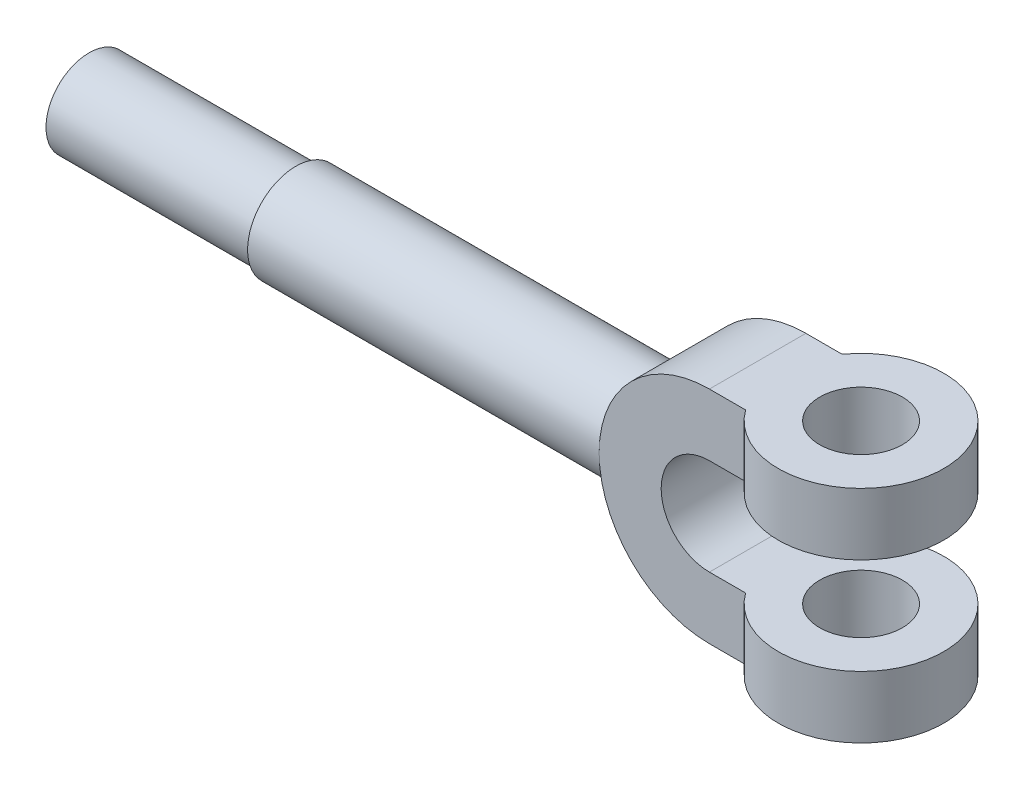
ISO-10303-21;
HEADER;
FILE_DESCRIPTION(('STEP AP214'),'2;1');
FILE_NAME('part.step','',(''),(''),'','','');
FILE_SCHEMA(('AUTOMOTIVE_DESIGN { 1 0 10303 214 1 1 1 1 }'));
ENDSEC;
DATA;
#1=APPLICATION_CONTEXT('core data for automotive mechanical design processes');
#2=APPLICATION_PROTOCOL_DEFINITION('international standard','automotive_design',2000,#1);
#3=PRODUCT_CONTEXT('',#1,'mechanical');
#4=PRODUCT('Part','Part','',(#3));
#5=PRODUCT_RELATED_PRODUCT_CATEGORY('part','',(#4));
#6=PRODUCT_DEFINITION_FORMATION('','',#4);
#7=PRODUCT_DEFINITION_CONTEXT('part definition',#1,'design');
#8=PRODUCT_DEFINITION('design','',#6,#7);
#9=PRODUCT_DEFINITION_SHAPE('','',#8);
#10=(LENGTH_UNIT() NAMED_UNIT(*) SI_UNIT(.MILLI.,.METRE.));
#11=(NAMED_UNIT(*) PLANE_ANGLE_UNIT() SI_UNIT($,.RADIAN.));
#12=(NAMED_UNIT(*) SI_UNIT($,.STERADIAN.) SOLID_ANGLE_UNIT());
#13=UNCERTAINTY_MEASURE_WITH_UNIT(LENGTH_MEASURE(1.E-05),#10,'distance_accuracy_value','');
#14=(GEOMETRIC_REPRESENTATION_CONTEXT(3) GLOBAL_UNCERTAINTY_ASSIGNED_CONTEXT((#13)) GLOBAL_UNIT_ASSIGNED_CONTEXT((#10,
#11,#12)) REPRESENTATION_CONTEXT('',''));
#15=CARTESIAN_POINT('',(0.,0.,0.));
#16=DIRECTION('',(0.,0.,1.));
#17=DIRECTION('',(1.,0.,0.));
#18=AXIS2_PLACEMENT_3D('',#15,#16,#17);
#19=CARTESIAN_POINT('',(-30.,0.,14.));
#20=DIRECTION('',(0.,0.,1.));
#21=DIRECTION('',(1.,0.,0.));
#22=AXIS2_PLACEMENT_3D('',#19,#20,#21);
#23=PLANE('',#22);
#24=DIRECTION('',(0.,-1.,0.));
#25=VECTOR('',#24,1.);
#26=CARTESIAN_POINT('',(-19.4935886896179,-14.,14.));
#27=LINE('',#26,#25);
#28=CARTESIAN_POINT('',(-19.4935886896179,-14.,14.));
#29=VERTEX_POINT('',#28);
#30=CARTESIAN_POINT('',(-19.4935886896179,-32.,14.));
#31=VERTEX_POINT('',#30);
#32=EDGE_CURVE('E117',#29,#31,#27,.T.);
#33=ORIENTED_EDGE('',*,*,#32,.F.);
#34=DIRECTION('',(-1.,0.,0.));
#35=VECTOR('',#34,1.);
#36=CARTESIAN_POINT('',(-30.,-14.,14.));
#37=LINE('',#36,#35);
#38=CARTESIAN_POINT('',(-30.,-14.,14.));
#39=VERTEX_POINT('',#38);
#40=EDGE_CURVE('E144',#29,#39,#37,.T.);
#41=ORIENTED_EDGE('',*,*,#40,.T.);
#42=CARTESIAN_POINT('',(-30.,0.,14.));
#43=DIRECTION('',(0.,0.,-1.));
#44=DIRECTION('',(1.,0.,0.));
#45=AXIS2_PLACEMENT_3D('',#42,#43,#44);
#46=CIRCLE('',#45,14.);
#47=CARTESIAN_POINT('',(-30.,14.,14.));
#48=VERTEX_POINT('',#47);
#49=EDGE_CURVE('E134',#39,#48,#46,.T.);
#50=ORIENTED_EDGE('',*,*,#49,.T.);
#51=DIRECTION('',(1.,0.,0.));
#52=VECTOR('',#51,1.);
#53=CARTESIAN_POINT('',(-30.,14.,14.));
#54=LINE('',#53,#52);
#55=CARTESIAN_POINT('',(-19.4935886896179,14.,14.));
#56=VERTEX_POINT('',#55);
#57=EDGE_CURVE('E183',#48,#56,#54,.T.);
#58=ORIENTED_EDGE('',*,*,#57,.T.);
#59=DIRECTION('',(0.,1.,0.));
#60=VECTOR('',#59,1.);
#61=CARTESIAN_POINT('',(-19.4935886896179,14.,14.));
#62=LINE('',#61,#60);
#63=CARTESIAN_POINT('',(-19.4935886896179,32.,14.));
#64=VERTEX_POINT('',#63);
#65=EDGE_CURVE('E246',#64,#56,#62,.F.);
#66=ORIENTED_EDGE('',*,*,#65,.F.);
#67=DIRECTION('',(-1.,0.,0.));
#68=VECTOR('',#67,1.);
#69=CARTESIAN_POINT('',(-30.,32.,14.));
#70=LINE('',#69,#68);
#71=CARTESIAN_POINT('',(-30.,32.,14.));
#72=VERTEX_POINT('',#71);
#73=EDGE_CURVE('E181',#64,#72,#70,.T.);
#74=ORIENTED_EDGE('',*,*,#73,.T.);
#75=CARTESIAN_POINT('',(-30.,0.,14.));
#76=DIRECTION('',(0.,0.,1.));
#77=DIRECTION('',(1.,0.,0.));
#78=AXIS2_PLACEMENT_3D('',#75,#76,#77);
#79=CIRCLE('',#78,32.);
#80=CARTESIAN_POINT('',(-62.,0.,14.));
#81=VERTEX_POINT('',#80);
#82=EDGE_CURVE('E177',#72,#81,#79,.T.);
#83=ORIENTED_EDGE('',*,*,#82,.T.);
#84=CARTESIAN_POINT('',(-30.,-32.,14.));
#85=VERTEX_POINT('',#84);
#86=EDGE_CURVE('E180',#81,#85,#79,.T.);
#87=ORIENTED_EDGE('',*,*,#86,.T.);
#88=DIRECTION('',(1.,0.,0.));
#89=VECTOR('',#88,1.);
#90=CARTESIAN_POINT('',(-30.,-32.,14.));
#91=LINE('',#90,#89);
#92=EDGE_CURVE('E175',#85,#31,#91,.T.);
#93=ORIENTED_EDGE('',*,*,#92,.T.);
#94=EDGE_LOOP('',(#33,#41,#50,#58,#66,#74,#83,#87,#93));
#95=FACE_BOUND('',#94,.T.);
#96=ADVANCED_FACE('F33',(#95),#23,.T.);
#97=CARTESIAN_POINT('',(-30.,0.,-14.));
#98=DIRECTION('',(0.,0.,1.));
#99=DIRECTION('',(1.,0.,0.));
#100=AXIS2_PLACEMENT_3D('',#97,#98,#99);
#101=PLANE('',#100);
#102=DIRECTION('',(-1.,0.,0.));
#103=VECTOR('',#102,1.);
#104=CARTESIAN_POINT('',(-30.,-14.,-14.));
#105=LINE('',#104,#103);
#106=CARTESIAN_POINT('',(-19.4935886896179,-14.,-14.));
#107=VERTEX_POINT('',#106);
#108=CARTESIAN_POINT('',(-30.,-14.,-14.));
#109=VERTEX_POINT('',#108);
#110=EDGE_CURVE('E127',#107,#109,#105,.T.);
#111=ORIENTED_EDGE('',*,*,#110,.F.);
#112=DIRECTION('',(0.,-1.,0.));
#113=VECTOR('',#112,1.);
#114=CARTESIAN_POINT('',(-19.4935886896179,-14.,-14.));
#115=LINE('',#114,#113);
#116=CARTESIAN_POINT('',(-19.4935886896179,-32.,-14.));
#117=VERTEX_POINT('',#116);
#118=EDGE_CURVE('E11',#107,#117,#115,.T.);
#119=ORIENTED_EDGE('',*,*,#118,.T.);
#120=DIRECTION('',(1.,0.,0.));
#121=VECTOR('',#120,1.);
#122=CARTESIAN_POINT('',(-30.,-32.,-14.));
#123=LINE('',#122,#121);
#124=CARTESIAN_POINT('',(-30.,-32.,-14.));
#125=VERTEX_POINT('',#124);
#126=EDGE_CURVE('E125',#125,#117,#123,.T.);
#127=ORIENTED_EDGE('',*,*,#126,.F.);
#128=CARTESIAN_POINT('',(-30.,0.,-14.));
#129=DIRECTION('',(0.,0.,1.));
#130=DIRECTION('',(1.,0.,0.));
#131=AXIS2_PLACEMENT_3D('',#128,#129,#130);
#132=CIRCLE('',#131,32.);
#133=CARTESIAN_POINT('',(-62.,0.,-14.));
#134=VERTEX_POINT('',#133);
#135=EDGE_CURVE('E137',#134,#125,#132,.T.);
#136=ORIENTED_EDGE('',*,*,#135,.F.);
#137=CARTESIAN_POINT('',(-30.,32.,-14.));
#138=VERTEX_POINT('',#137);
#139=EDGE_CURVE('E132',#138,#134,#132,.T.);
#140=ORIENTED_EDGE('',*,*,#139,.F.);
#141=DIRECTION('',(-1.,0.,0.));
#142=VECTOR('',#141,1.);
#143=CARTESIAN_POINT('',(-30.,32.,-14.));
#144=LINE('',#143,#142);
#145=CARTESIAN_POINT('',(-19.4935886896179,32.,-14.));
#146=VERTEX_POINT('',#145);
#147=EDGE_CURVE('E161',#146,#138,#144,.T.);
#148=ORIENTED_EDGE('',*,*,#147,.F.);
#149=DIRECTION('',(0.,1.,0.));
#150=VECTOR('',#149,1.);
#151=CARTESIAN_POINT('',(-19.4935886896179,14.,-14.));
#152=LINE('',#151,#150);
#153=CARTESIAN_POINT('',(-19.4935886896179,14.,-14.));
#154=VERTEX_POINT('',#153);
#155=EDGE_CURVE('E42',#146,#154,#152,.F.);
#156=ORIENTED_EDGE('',*,*,#155,.T.);
#157=DIRECTION('',(1.,0.,0.));
#158=VECTOR('',#157,1.);
#159=CARTESIAN_POINT('',(-30.,14.,-14.));
#160=LINE('',#159,#158);
#161=CARTESIAN_POINT('',(-30.,14.,-14.));
#162=VERTEX_POINT('',#161);
#163=EDGE_CURVE('E159',#162,#154,#160,.T.);
#164=ORIENTED_EDGE('',*,*,#163,.F.);
#165=CARTESIAN_POINT('',(-30.,0.,-14.));
#166=DIRECTION('',(0.,0.,-1.));
#167=DIRECTION('',(1.,0.,0.));
#168=AXIS2_PLACEMENT_3D('',#165,#166,#167);
#169=CIRCLE('',#168,14.);
#170=EDGE_CURVE('E169',#109,#162,#169,.T.);
#171=ORIENTED_EDGE('',*,*,#170,.F.);
#172=EDGE_LOOP('',(#111,#119,#127,#136,#140,#148,#156,#164,#171));
#173=FACE_BOUND('',#172,.T.);
#174=ADVANCED_FACE('F123',(#173),#101,.F.);
#175=CARTESIAN_POINT('',(-30.,0.,14.));
#176=DIRECTION('',(0.,0.,-1.));
#177=DIRECTION('',(-1.,0.,0.));
#178=AXIS2_PLACEMENT_3D('',#175,#176,#177);
#179=CYLINDRICAL_SURFACE('',#178,32.);
#180=ORIENTED_EDGE('',*,*,#86,.F.);
#181=CARTESIAN_POINT('',(-60.,11.13552872566,8.48528137423866));
#182=CARTESIAN_POINT('',(-60.0891416735585,10.8954081648789,8.80041326800746));
#183=CARTESIAN_POINT('',(-60.1798663171623,10.6421221054646,9.10504866610022));
#184=CARTESIAN_POINT('',(-60.3620049023524,10.110753097651,9.69171091621338));
#185=CARTESIAN_POINT('',(-60.4534189205508,9.83266735488153,9.97373521365168));
#186=CARTESIAN_POINT('',(-60.6346923988891,9.25247493902495,10.5142452852405));
#187=CARTESIAN_POINT('',(-60.7245467759871,8.95030303981234,10.7726627752637));
#188=CARTESIAN_POINT('',(-60.9000236500598,8.32431185627647,11.2633913223623));
#189=CARTESIAN_POINT('',(-60.9856463138151,8.00049342627305,11.4957034087662));
#190=CARTESIAN_POINT('',(-61.1504963149408,7.33247039375538,11.9329162885069));
#191=CARTESIAN_POINT('',(-61.229712549137,6.98823211768616,12.1377698801392));
#192=CARTESIAN_POINT('',(-61.3794033128808,6.2819830647539,12.5178864488918));
#193=CARTESIAN_POINT('',(-61.4498784710278,5.91997356849346,12.6931515541442));
#194=CARTESIAN_POINT('',(-61.5800098646172,5.18107037887676,13.0122335552156));
#195=CARTESIAN_POINT('',(-61.6396810237719,4.80419810626767,13.1560938882958));
#196=CARTESIAN_POINT('',(-61.7465820347211,4.03784099603448,13.4111480558289));
#197=CARTESIAN_POINT('',(-61.793812695569,3.64835698045109,13.5223440146251));
#198=CARTESIAN_POINT('',(-61.8723901402317,2.87966036389742,13.7060493041297));
#199=CARTESIAN_POINT('',(-61.9044154335629,2.50091407265334,13.7802208855826));
#200=CARTESIAN_POINT('',(-61.9550716394068,1.73770725735285,13.8970999605917));
#201=CARTESIAN_POINT('',(-61.9737029579125,1.35324690685939,13.9398084078473));
#202=CARTESIAN_POINT('',(-61.9970405643804,0.581688035935338,13.993254918077));
#203=CARTESIAN_POINT('',(-62.0017468537878,0.194589515778528,14.0039929843687));
#204=CARTESIAN_POINT('',(-61.9970982293181,-0.579073624885983,13.9933671049503));
#205=CARTESIAN_POINT('',(-61.9877438607025,-0.965638265515265,13.9720044040832));
#206=CARTESIAN_POINT('',(-61.9562598452542,-1.71110573054767,13.8997665712455));
#207=CARTESIAN_POINT('',(-61.9349620858365,-2.07023198625642,13.8508122413411));
#208=CARTESIAN_POINT('',(-61.880777430786,-2.78274544491058,13.7254204609935));
#209=CARTESIAN_POINT('',(-61.8478910723864,-3.13613291310478,13.6489842845714));
#210=CARTESIAN_POINT('',(-61.7713300340717,-3.83485739191832,13.4693728591817));
#211=CARTESIAN_POINT('',(-61.7276547689635,-4.18019396474272,13.3661961597862));
#212=CARTESIAN_POINT('',(-61.6305559887906,-4.86066493123707,13.1340466772797));
#213=CARTESIAN_POINT('',(-61.5771322871519,-5.19579912950185,13.0050734004467));
#214=CARTESIAN_POINT('',(-61.4604772093516,-5.86131826987372,12.7192384325392));
#215=CARTESIAN_POINT('',(-61.3970529560342,-6.19142869536892,12.5618167810891));
#216=CARTESIAN_POINT('',(-61.2627866458882,-6.83717449408628,12.2223616183369));
#217=CARTESIAN_POINT('',(-61.1919441029775,-7.15280891682005,12.0403264940137));
#218=CARTESIAN_POINT('',(-61.0444627308938,-7.76797070725121,11.6529285684529));
#219=CARTESIAN_POINT('',(-60.9678241373081,-8.06749872876633,11.4475667151875));
#220=CARTESIAN_POINT('',(-60.8104903626922,-8.64895596471065,11.0148495054767));
#221=CARTESIAN_POINT('',(-60.7297959688951,-8.9308885707858,10.7874984092966));
#222=CARTESIAN_POINT('',(-60.5409600626284,-9.55970375161997,10.2389205096295));
#223=CARTESIAN_POINT('',(-60.4320012172305,-9.8999366481768,9.91030885741411));
#224=CARTESIAN_POINT('',(-60.2146131992373,-10.5448220386832,9.22112711272913));
#225=CARTESIAN_POINT('',(-60.1061833887424,-10.8495511493989,8.86062890618317));
#226=CARTESIAN_POINT('',(-60.,-11.13552872566,8.48528137423866));
#227=B_SPLINE_CURVE_WITH_KNOTS('',3,(#181,#182,#183,#184,#185,#186,#187,#188,#189,#190,#191,
#192,#193,#194,#195,#196,#197,#198,#199,#200,#201,#202,#203,#204,#205,#206,#207,#208,#209,#210,
#211,#212,#213,#214,#215,#216,#217,#218,#219,#220,#221,#222,#223,#224,#225,#226),.UNSPECIFIED.,
.F.,.F.,(4,2,2,2,2,2,2,2,2,2,2,2,2,2,2,2,2,2,2,2,2,2,4),(0.,1.21791559927311,2.43596860423622,
3.65744016774213,4.87886355207254,6.10236037301812,7.32576915725063,8.54747491857627,
9.76910120807494,10.9293840898815,12.0896318001593,13.2498793900363,14.41008198757,
15.4980305481547,16.5859286794227,17.6738858315271,18.7618638080827,19.8742111887175,
20.9866315013682,22.0990066226669,23.2111666589675,24.6649392116109,26.115514035862),.UNSPECIFIED.);
#228=CARTESIAN_POINT('',(-60.,-11.13552872566,8.48528137423857));
#229=VERTEX_POINT('',#228);
#230=EDGE_CURVE('E187',#81,#229,#227,.T.);
#231=ORIENTED_EDGE('',*,*,#230,.T.);
#232=DIRECTION('',(0.,0.,-1.));
#233=VECTOR('',#232,1.);
#234=CARTESIAN_POINT('',(-60.,-11.13552872566,14.));
#235=LINE('',#234,#233);
#236=CARTESIAN_POINT('',(-60.,-11.13552872566,-8.48528137423857));
#237=VERTEX_POINT('',#236);
#238=EDGE_CURVE('E262',#229,#237,#235,.T.);
#239=ORIENTED_EDGE('',*,*,#238,.T.);
#240=CARTESIAN_POINT('',(-60.,-11.13552872566,-8.48528137423866));
#241=CARTESIAN_POINT('',(-60.0891416735585,-10.8954081648789,-8.80041326800746));
#242=CARTESIAN_POINT('',(-60.1798663171623,-10.6421221054646,-9.10504866610022));
#243=CARTESIAN_POINT('',(-60.3620049023524,-10.110753097651,-9.69171091621338));
#244=CARTESIAN_POINT('',(-60.4534189205508,-9.83266735488153,-9.97373521365168));
#245=CARTESIAN_POINT('',(-60.6346923988891,-9.25247493902495,-10.5142452852405));
#246=CARTESIAN_POINT('',(-60.7245467759871,-8.95030303981234,-10.7726627752637));
#247=CARTESIAN_POINT('',(-60.9000236500598,-8.32431185627647,-11.2633913223623));
#248=CARTESIAN_POINT('',(-60.9856463138151,-8.00049342627305,-11.4957034087662));
#249=CARTESIAN_POINT('',(-61.1504963149408,-7.33247039375538,-11.9329162885069));
#250=CARTESIAN_POINT('',(-61.229712549137,-6.98823211768616,-12.1377698801392));
#251=CARTESIAN_POINT('',(-61.3794033128808,-6.2819830647539,-12.5178864488918));
#252=CARTESIAN_POINT('',(-61.4498784710278,-5.91997356849346,-12.6931515541442));
#253=CARTESIAN_POINT('',(-61.5800098646172,-5.18107037887676,-13.0122335552156));
#254=CARTESIAN_POINT('',(-61.6396810237719,-4.80419810626767,-13.1560938882958));
#255=CARTESIAN_POINT('',(-61.7465820347211,-4.03784099603448,-13.4111480558289));
#256=CARTESIAN_POINT('',(-61.793812695569,-3.64835698045109,-13.5223440146251));
#257=CARTESIAN_POINT('',(-61.8723901402317,-2.87966036389742,-13.7060493041297));
#258=CARTESIAN_POINT('',(-61.9044154335629,-2.50091407265334,-13.7802208855826));
#259=CARTESIAN_POINT('',(-61.9550716394068,-1.73770725735285,-13.8970999605917));
#260=CARTESIAN_POINT('',(-61.9737029579125,-1.35324690685939,-13.9398084078473));
#261=CARTESIAN_POINT('',(-61.9970405643804,-0.581688035935338,-13.993254918077));
#262=CARTESIAN_POINT('',(-62.0017468537878,-0.194589515778528,-14.0039929843687));
#263=CARTESIAN_POINT('',(-61.9970982293181,0.579073624885983,-13.9933671049503));
#264=CARTESIAN_POINT('',(-61.9877438607025,0.965638265515265,-13.9720044040832));
#265=CARTESIAN_POINT('',(-61.9562598452542,1.71110573054767,-13.8997665712455));
#266=CARTESIAN_POINT('',(-61.9349620858365,2.07023198625642,-13.8508122413411));
#267=CARTESIAN_POINT('',(-61.880777430786,2.78274544491058,-13.7254204609935));
#268=CARTESIAN_POINT('',(-61.8478910723864,3.13613291310478,-13.6489842845714));
#269=CARTESIAN_POINT('',(-61.7713300340717,3.83485739191832,-13.4693728591817));
#270=CARTESIAN_POINT('',(-61.7276547689635,4.18019396474272,-13.3661961597862));
#271=CARTESIAN_POINT('',(-61.6305559887906,4.86066493123707,-13.1340466772797));
#272=CARTESIAN_POINT('',(-61.5771322871519,5.19579912950185,-13.0050734004467));
#273=CARTESIAN_POINT('',(-61.4604772093516,5.86131826987372,-12.7192384325392));
#274=CARTESIAN_POINT('',(-61.3970529560342,6.19142869536892,-12.5618167810891));
#275=CARTESIAN_POINT('',(-61.2627866458882,6.83717449408628,-12.2223616183369));
#276=CARTESIAN_POINT('',(-61.1919441029775,7.15280891682005,-12.0403264940137));
#277=CARTESIAN_POINT('',(-61.0444627308938,7.76797070725121,-11.6529285684529));
#278=CARTESIAN_POINT('',(-60.9678241373081,8.06749872876633,-11.4475667151875));
#279=CARTESIAN_POINT('',(-60.8104903626922,8.64895596471065,-11.0148495054767));
#280=CARTESIAN_POINT('',(-60.7297959688951,8.9308885707858,-10.7874984092966));
#281=CARTESIAN_POINT('',(-60.5409600626284,9.55970375161997,-10.2389205096295));
#282=CARTESIAN_POINT('',(-60.4320012172305,9.8999366481768,-9.91030885741411));
#283=CARTESIAN_POINT('',(-60.2146131992373,10.5448220386832,-9.22112711272913));
#284=CARTESIAN_POINT('',(-60.1061833887424,10.8495511493989,-8.86062890618317));
#285=CARTESIAN_POINT('',(-60.,11.13552872566,-8.48528137423866));
#286=B_SPLINE_CURVE_WITH_KNOTS('',3,(#240,#241,#242,#243,#244,#245,#246,#247,#248,#249,#250,
#251,#252,#253,#254,#255,#256,#257,#258,#259,#260,#261,#262,#263,#264,#265,#266,#267,#268,#269,
#270,#271,#272,#273,#274,#275,#276,#277,#278,#279,#280,#281,#282,#283,#284,#285),.UNSPECIFIED.,
.F.,.F.,(4,2,2,2,2,2,2,2,2,2,2,2,2,2,2,2,2,2,2,2,2,2,4),(0.,1.21791559927311,2.43596860423622,
3.65744016774213,4.87886355207254,6.10236037301812,7.32576915725063,8.54747491857627,
9.76910120807494,10.9293840898815,12.0896318001593,13.2498793900363,14.41008198757,
15.4980305481547,16.5859286794227,17.6738858315271,18.7618638080827,19.8742111887175,
20.9866315013682,22.0990066226669,23.2111666589675,24.6649392116109,26.115514035862),.UNSPECIFIED.);
#287=EDGE_CURVE('E171',#237,#134,#286,.T.);
#288=ORIENTED_EDGE('',*,*,#287,.T.);
#289=ORIENTED_EDGE('',*,*,#135,.T.);
#290=DIRECTION('',(0.,0.,-1.));
#291=VECTOR('',#290,1.);
#292=CARTESIAN_POINT('',(-30.,-32.,14.));
#293=LINE('',#292,#291);
#294=EDGE_CURVE('E131',#85,#125,#293,.T.);
#295=ORIENTED_EDGE('',*,*,#294,.F.);
#296=EDGE_LOOP('',(#180,#231,#239,#288,#289,#295));
#297=FACE_BOUND('',#296,.T.);
#298=ADVANCED_FACE('F220',(#297),#179,.T.);
#299=CARTESIAN_POINT('',(-30.,0.,14.));
#300=DIRECTION('',(0.,0.,-1.));
#301=DIRECTION('',(-1.,0.,0.));
#302=AXIS2_PLACEMENT_3D('',#299,#300,#301);
#303=CYLINDRICAL_SURFACE('',#302,14.);
#304=ORIENTED_EDGE('',*,*,#170,.T.);
#305=DIRECTION('',(0.,0.,-1.));
#306=VECTOR('',#305,1.);
#307=CARTESIAN_POINT('',(-30.,14.,14.));
#308=LINE('',#307,#306);
#309=EDGE_CURVE('E149',#48,#162,#308,.T.);
#310=ORIENTED_EDGE('',*,*,#309,.F.);
#311=ORIENTED_EDGE('',*,*,#49,.F.);
#312=DIRECTION('',(0.,0.,-1.));
#313=VECTOR('',#312,1.);
#314=CARTESIAN_POINT('',(-30.,-14.,14.));
#315=LINE('',#314,#313);
#316=EDGE_CURVE('E141',#39,#109,#315,.T.);
#317=ORIENTED_EDGE('',*,*,#316,.T.);
#318=EDGE_LOOP('',(#304,#310,#311,#317));
#319=FACE_BOUND('',#318,.T.);
#320=ADVANCED_FACE('F35',(#319),#303,.F.);
#321=CARTESIAN_POINT('',(-30.,14.,14.));
#322=DIRECTION('',(0.,1.,0.));
#323=DIRECTION('',(0.,0.,1.));
#324=AXIS2_PLACEMENT_3D('',#321,#322,#323);
#325=PLANE('',#324);
#326=CARTESIAN_POINT('',(0.,14.,0.));
#327=DIRECTION('',(0.,1.,0.));
#328=DIRECTION('',(0.,0.,1.));
#329=AXIS2_PLACEMENT_3D('',#326,#327,#328);
#330=CIRCLE('',#329,12.);
#331=CARTESIAN_POINT('',(0.,14.,12.));
#332=VERTEX_POINT('',#331);
#333=EDGE_CURVE('E118',#332,#332,#330,.T.);
#334=ORIENTED_EDGE('',*,*,#333,.T.);
#335=EDGE_LOOP('',(#334));
#336=FACE_BOUND('',#335,.T.);
#337=CARTESIAN_POINT('',(0.,14.,0.));
#338=DIRECTION('',(0.,1.,0.));
#339=DIRECTION('',(0.,0.,1.));
#340=AXIS2_PLACEMENT_3D('',#337,#338,#339);
#341=CIRCLE('',#340,24.);
#342=EDGE_CURVE('E165',#56,#154,#341,.T.);
#343=ORIENTED_EDGE('',*,*,#342,.F.);
#344=ORIENTED_EDGE('',*,*,#57,.F.);
#345=ORIENTED_EDGE('',*,*,#309,.T.);
#346=ORIENTED_EDGE('',*,*,#163,.T.);
#347=EDGE_LOOP('',(#343,#344,#345,#346));
#348=FACE_BOUND('',#347,.T.);
#349=ADVANCED_FACE('F164',(#336,#348),#325,.F.);
#350=CARTESIAN_POINT('',(-30.,32.,14.));
#351=DIRECTION('',(0.,-1.,0.));
#352=DIRECTION('',(0.,0.,-1.));
#353=AXIS2_PLACEMENT_3D('',#350,#351,#352);
#354=PLANE('',#353);
#355=CARTESIAN_POINT('',(0.,32.,0.));
#356=DIRECTION('',(0.,-1.,0.));
#357=DIRECTION('',(0.,0.,-1.));
#358=AXIS2_PLACEMENT_3D('',#355,#356,#357);
#359=CIRCLE('',#358,12.);
#360=CARTESIAN_POINT('',(0.,32.,-12.));
#361=VERTEX_POINT('',#360);
#362=EDGE_CURVE('E236',#361,#361,#359,.T.);
#363=ORIENTED_EDGE('',*,*,#362,.T.);
#364=EDGE_LOOP('',(#363));
#365=FACE_BOUND('',#364,.T.);
#366=ORIENTED_EDGE('',*,*,#73,.F.);
#367=CARTESIAN_POINT('',(0.,32.,0.));
#368=DIRECTION('',(0.,1.,0.));
#369=DIRECTION('',(0.,0.,1.));
#370=AXIS2_PLACEMENT_3D('',#367,#368,#369);
#371=CIRCLE('',#370,24.);
#372=EDGE_CURVE('E244',#64,#146,#371,.T.);
#373=ORIENTED_EDGE('',*,*,#372,.T.);
#374=ORIENTED_EDGE('',*,*,#147,.T.);
#375=DIRECTION('',(0.,0.,-1.));
#376=VECTOR('',#375,1.);
#377=CARTESIAN_POINT('',(-30.,32.,14.));
#378=LINE('',#377,#376);
#379=EDGE_CURVE('E146',#72,#138,#378,.T.);
#380=ORIENTED_EDGE('',*,*,#379,.F.);
#381=EDGE_LOOP('',(#366,#373,#374,#380));
#382=FACE_BOUND('',#381,.T.);
#383=ADVANCED_FACE('F228',(#365,#382),#354,.F.);
#384=ORIENTED_EDGE('',*,*,#139,.T.);
#385=CARTESIAN_POINT('',(-60.,11.13552872566,-8.48528137423857));
#386=VERTEX_POINT('',#385);
#387=EDGE_CURVE('E196',#134,#386,#286,.T.);
#388=ORIENTED_EDGE('',*,*,#387,.T.);
#389=DIRECTION('',(0.,0.,-1.));
#390=VECTOR('',#389,1.);
#391=CARTESIAN_POINT('',(-60.,11.13552872566,14.));
#392=LINE('',#391,#390);
#393=CARTESIAN_POINT('',(-60.,11.13552872566,8.48528137423857));
#394=VERTEX_POINT('',#393);
#395=EDGE_CURVE('E257',#386,#394,#392,.F.);
#396=ORIENTED_EDGE('',*,*,#395,.T.);
#397=EDGE_CURVE('E195',#394,#81,#227,.T.);
#398=ORIENTED_EDGE('',*,*,#397,.T.);
#399=ORIENTED_EDGE('',*,*,#82,.F.);
#400=ORIENTED_EDGE('',*,*,#379,.T.);
#401=EDGE_LOOP('',(#384,#388,#396,#398,#399,#400));
#402=FACE_BOUND('',#401,.T.);
#403=ADVANCED_FACE('F201',(#402),#179,.T.);
#404=CARTESIAN_POINT('',(-30.,-32.,14.));
#405=DIRECTION('',(0.,1.,0.));
#406=DIRECTION('',(0.,0.,1.));
#407=AXIS2_PLACEMENT_3D('',#404,#405,#406);
#408=PLANE('',#407);
#409=CARTESIAN_POINT('',(0.,-32.,0.));
#410=DIRECTION('',(0.,-1.,0.));
#411=DIRECTION('',(0.,0.,-1.));
#412=AXIS2_PLACEMENT_3D('',#409,#410,#411);
#413=CIRCLE('',#412,12.);
#414=CARTESIAN_POINT('',(0.,-32.,-12.));
#415=VERTEX_POINT('',#414);
#416=EDGE_CURVE('E232',#415,#415,#413,.T.);
#417=ORIENTED_EDGE('',*,*,#416,.F.);
#418=EDGE_LOOP('',(#417));
#419=FACE_BOUND('',#418,.T.);
#420=CARTESIAN_POINT('',(0.,-32.,0.));
#421=DIRECTION('',(0.,-1.,0.));
#422=DIRECTION('',(0.,0.,-1.));
#423=AXIS2_PLACEMENT_3D('',#420,#421,#422);
#424=CIRCLE('',#423,24.);
#425=EDGE_CURVE('E57',#117,#31,#424,.T.);
#426=ORIENTED_EDGE('',*,*,#425,.T.);
#427=ORIENTED_EDGE('',*,*,#92,.F.);
#428=ORIENTED_EDGE('',*,*,#294,.T.);
#429=ORIENTED_EDGE('',*,*,#126,.T.);
#430=EDGE_LOOP('',(#426,#427,#428,#429));
#431=FACE_BOUND('',#430,.T.);
#432=ADVANCED_FACE('F129',(#419,#431),#408,.F.);
#433=CARTESIAN_POINT('',(-30.,-14.,14.));
#434=DIRECTION('',(0.,-1.,0.));
#435=DIRECTION('',(0.,0.,-1.));
#436=AXIS2_PLACEMENT_3D('',#433,#434,#435);
#437=PLANE('',#436);
#438=CARTESIAN_POINT('',(0.,-14.,0.));
#439=DIRECTION('',(0.,-1.,0.));
#440=DIRECTION('',(0.,0.,-1.));
#441=AXIS2_PLACEMENT_3D('',#438,#439,#440);
#442=CIRCLE('',#441,12.);
#443=CARTESIAN_POINT('',(0.,-14.,-12.));
#444=VERTEX_POINT('',#443);
#445=EDGE_CURVE('E37',#444,#444,#442,.T.);
#446=ORIENTED_EDGE('',*,*,#445,.T.);
#447=EDGE_LOOP('',(#446));
#448=FACE_BOUND('',#447,.T.);
#449=ORIENTED_EDGE('',*,*,#40,.F.);
#450=CARTESIAN_POINT('',(0.,-14.,0.));
#451=DIRECTION('',(0.,-1.,0.));
#452=DIRECTION('',(0.,0.,-1.));
#453=AXIS2_PLACEMENT_3D('',#450,#451,#452);
#454=CIRCLE('',#453,24.);
#455=EDGE_CURVE('E49',#107,#29,#454,.T.);
#456=ORIENTED_EDGE('',*,*,#455,.F.);
#457=ORIENTED_EDGE('',*,*,#110,.T.);
#458=ORIENTED_EDGE('',*,*,#316,.F.);
#459=EDGE_LOOP('',(#449,#456,#457,#458));
#460=FACE_BOUND('',#459,.T.);
#461=ADVANCED_FACE('F211',(#448,#460),#437,.F.);
#462=CARTESIAN_POINT('',(-164.,0.,0.));
#463=DIRECTION('',(1.,0.,0.));
#464=DIRECTION('',(0.,0.,-1.));
#465=AXIS2_PLACEMENT_3D('',#462,#463,#464);
#466=CYLINDRICAL_SURFACE('',#465,14.);
#467=CARTESIAN_POINT('',(-164.,0.,0.));
#468=DIRECTION('',(1.,0.,0.));
#469=DIRECTION('',(0.,0.,-1.));
#470=AXIS2_PLACEMENT_3D('',#467,#468,#469);
#471=CIRCLE('',#470,14.);
#472=CARTESIAN_POINT('',(-164.,0.,-14.));
#473=VERTEX_POINT('',#472);
#474=EDGE_CURVE('E254',#473,#473,#471,.T.);
#475=ORIENTED_EDGE('',*,*,#474,.T.);
#476=EDGE_LOOP('',(#475));
#477=FACE_BOUND('',#476,.T.);
#478=ORIENTED_EDGE('',*,*,#287,.F.);
#479=CARTESIAN_POINT('',(-60.,0.,0.));
#480=DIRECTION('',(1.,0.,0.));
#481=DIRECTION('',(0.,0.,-1.));
#482=AXIS2_PLACEMENT_3D('',#479,#480,#481);
#483=CIRCLE('',#482,14.);
#484=EDGE_CURVE('E253',#229,#237,#483,.T.);
#485=ORIENTED_EDGE('',*,*,#484,.F.);
#486=ORIENTED_EDGE('',*,*,#230,.F.);
#487=ORIENTED_EDGE('',*,*,#397,.F.);
#488=EDGE_CURVE('E258',#386,#394,#483,.T.);
#489=ORIENTED_EDGE('',*,*,#488,.F.);
#490=ORIENTED_EDGE('',*,*,#387,.F.);
#491=EDGE_LOOP('',(#478,#485,#486,#487,#489,#490));
#492=FACE_BOUND('',#491,.T.);
#493=ADVANCED_FACE('F205',(#477,#492),#466,.T.);
#494=CARTESIAN_POINT('',(-60.,0.,0.));
#495=DIRECTION('',(1.,0.,0.));
#496=DIRECTION('',(0.,0.,-1.));
#497=AXIS2_PLACEMENT_3D('',#494,#495,#496);
#498=PLANE('',#497);
#499=ORIENTED_EDGE('',*,*,#238,.F.);
#500=ORIENTED_EDGE('',*,*,#484,.T.);
#501=EDGE_LOOP('',(#499,#500));
#502=FACE_BOUND('',#501,.T.);
#503=ADVANCED_FACE('F210',(#502),#498,.T.);
#504=ORIENTED_EDGE('',*,*,#395,.F.);
#505=ORIENTED_EDGE('',*,*,#488,.T.);
#506=EDGE_LOOP('',(#504,#505));
#507=FACE_BOUND('',#506,.T.);
#508=ADVANCED_FACE('F296',(#507),#498,.T.);
#509=CARTESIAN_POINT('',(-164.,0.,0.));
#510=DIRECTION('',(1.,0.,0.));
#511=DIRECTION('',(0.,0.,-1.));
#512=AXIS2_PLACEMENT_3D('',#509,#510,#511);
#513=PLANE('',#512);
#514=CARTESIAN_POINT('',(-164.,0.,0.));
#515=DIRECTION('',(1.,0.,0.));
#516=DIRECTION('',(0.,0.,-1.));
#517=AXIS2_PLACEMENT_3D('',#514,#515,#516);
#518=CIRCLE('',#517,12.5);
#519=CARTESIAN_POINT('',(-164.,0.,-12.5));
#520=VERTEX_POINT('',#519);
#521=EDGE_CURVE('E152',#520,#520,#518,.F.);
#522=ORIENTED_EDGE('',*,*,#521,.F.);
#523=EDGE_LOOP('',(#522));
#524=FACE_BOUND('',#523,.T.);
#525=ORIENTED_EDGE('',*,*,#474,.F.);
#526=EDGE_LOOP('',(#525));
#527=FACE_BOUND('',#526,.T.);
#528=ADVANCED_FACE('F293',(#524,#527),#513,.F.);
#529=CARTESIAN_POINT('',(-224.,0.,0.));
#530=DIRECTION('',(1.,0.,0.));
#531=DIRECTION('',(0.,0.,-1.));
#532=AXIS2_PLACEMENT_3D('',#529,#530,#531);
#533=CYLINDRICAL_SURFACE('',#532,12.5);
#534=CARTESIAN_POINT('',(-224.,0.,0.));
#535=DIRECTION('',(-1.,0.,0.));
#536=DIRECTION('',(0.,0.,1.));
#537=AXIS2_PLACEMENT_3D('',#534,#535,#536);
#538=CIRCLE('',#537,12.5);
#539=CARTESIAN_POINT('',(-224.,0.,12.5));
#540=VERTEX_POINT('',#539);
#541=EDGE_CURVE('E250',#540,#540,#538,.T.);
#542=ORIENTED_EDGE('',*,*,#541,.F.);
#543=EDGE_LOOP('',(#542));
#544=FACE_BOUND('',#543,.T.);
#545=ORIENTED_EDGE('',*,*,#521,.T.);
#546=EDGE_LOOP('',(#545));
#547=FACE_BOUND('',#546,.T.);
#548=ADVANCED_FACE('F287',(#544,#547),#533,.T.);
#549=CARTESIAN_POINT('',(-224.,0.,0.));
#550=DIRECTION('',(-1.,0.,0.));
#551=DIRECTION('',(0.,0.,1.));
#552=AXIS2_PLACEMENT_3D('',#549,#550,#551);
#553=PLANE('',#552);
#554=ORIENTED_EDGE('',*,*,#541,.T.);
#555=EDGE_LOOP('',(#554));
#556=FACE_BOUND('',#555,.T.);
#557=ADVANCED_FACE('F279',(#556),#553,.T.);
#558=CARTESIAN_POINT('',(0.,14.,0.));
#559=DIRECTION('',(0.,1.,0.));
#560=DIRECTION('',(0.,0.,1.));
#561=AXIS2_PLACEMENT_3D('',#558,#559,#560);
#562=CYLINDRICAL_SURFACE('',#561,24.);
#563=ORIENTED_EDGE('',*,*,#372,.F.);
#564=ORIENTED_EDGE('',*,*,#65,.T.);
#565=ORIENTED_EDGE('',*,*,#342,.T.);
#566=ORIENTED_EDGE('',*,*,#155,.F.);
#567=EDGE_LOOP('',(#563,#564,#565,#566));
#568=FACE_BOUND('',#567,.T.);
#569=ADVANCED_FACE('F277',(#568),#562,.T.);
#570=CARTESIAN_POINT('',(0.,-14.,0.));
#571=DIRECTION('',(0.,-1.,0.));
#572=DIRECTION('',(0.,0.,-1.));
#573=AXIS2_PLACEMENT_3D('',#570,#571,#572);
#574=CYLINDRICAL_SURFACE('',#573,24.);
#575=ORIENTED_EDGE('',*,*,#118,.F.);
#576=ORIENTED_EDGE('',*,*,#455,.T.);
#577=ORIENTED_EDGE('',*,*,#32,.T.);
#578=ORIENTED_EDGE('',*,*,#425,.F.);
#579=EDGE_LOOP('',(#575,#576,#577,#578));
#580=FACE_BOUND('',#579,.T.);
#581=ADVANCED_FACE('F116',(#580),#574,.T.);
#582=CARTESIAN_POINT('',(0.,53.,0.));
#583=DIRECTION('',(0.,-1.,0.));
#584=DIRECTION('',(0.,0.,-1.));
#585=AXIS2_PLACEMENT_3D('',#582,#583,#584);
#586=CYLINDRICAL_SURFACE('',#585,12.);
#587=ORIENTED_EDGE('',*,*,#416,.T.);
#588=EDGE_LOOP('',(#587));
#589=FACE_BOUND('',#588,.T.);
#590=ORIENTED_EDGE('',*,*,#445,.F.);
#591=EDGE_LOOP('',(#590));
#592=FACE_BOUND('',#591,.T.);
#593=ADVANCED_FACE('F285',(#589,#592),#586,.F.);
#594=ORIENTED_EDGE('',*,*,#362,.F.);
#595=EDGE_LOOP('',(#594));
#596=FACE_BOUND('',#595,.T.);
#597=ORIENTED_EDGE('',*,*,#333,.F.);
#598=EDGE_LOOP('',(#597));
#599=FACE_BOUND('',#598,.T.);
#600=ADVANCED_FACE('F397',(#596,#599),#586,.F.);
#601=CLOSED_SHELL('',(#96,#174,#298,#320,#349,#383,#403,#432,#461,#493,#503,#508,#528,#548,#557,
#569,#581,#593,#600));
#602=MANIFOLD_SOLID_BREP('B2',#601);
#603=ADVANCED_BREP_SHAPE_REPRESENTATION('',(#18,#602),#14);
#604=SHAPE_DEFINITION_REPRESENTATION(#9,#603);
ENDSEC;
END-ISO-10303-21;
